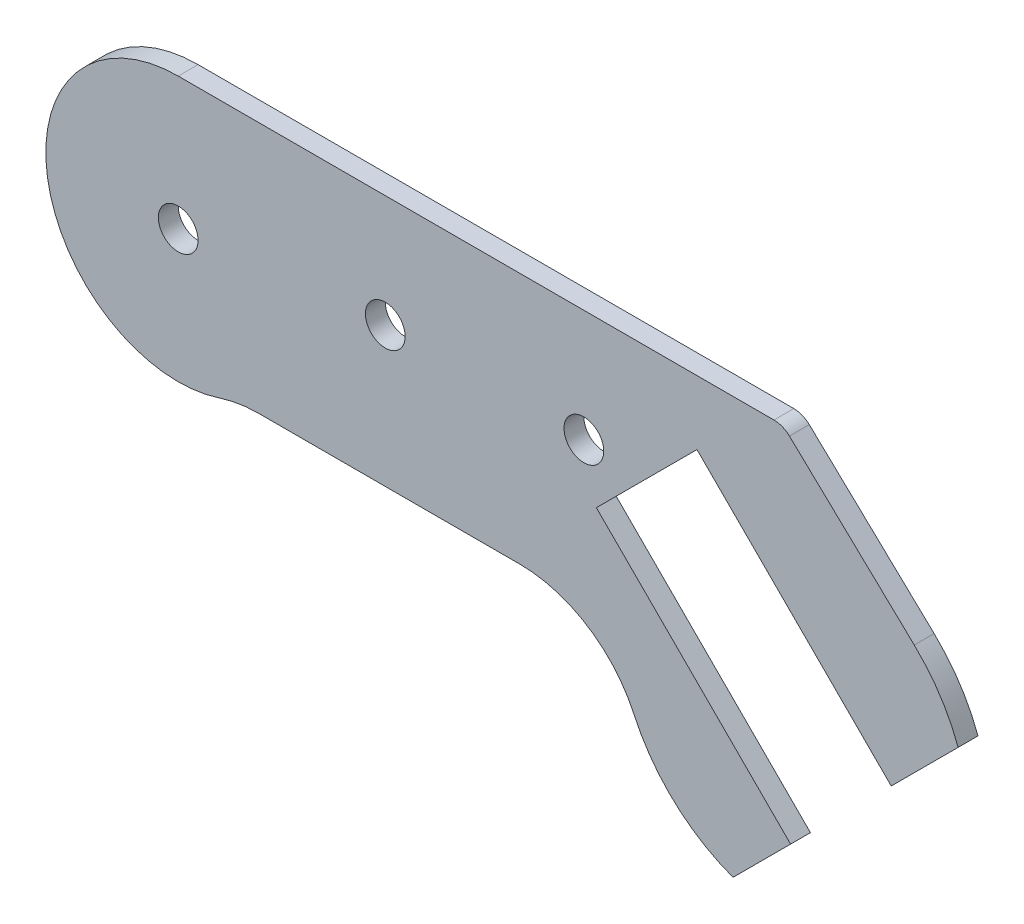
ISO-10303-21;
HEADER;
FILE_DESCRIPTION(('STEP AP214'),'2;1');
FILE_NAME('part.step','',(''),(''),'','','');
FILE_SCHEMA(('AUTOMOTIVE_DESIGN { 1 0 10303 214 1 1 1 1 }'));
ENDSEC;
DATA;
#1=APPLICATION_CONTEXT('core data for automotive mechanical design processes');
#2=APPLICATION_PROTOCOL_DEFINITION('international standard','automotive_design',2000,#1);
#3=PRODUCT_CONTEXT('',#1,'mechanical');
#4=PRODUCT('Part','Part','',(#3));
#5=PRODUCT_RELATED_PRODUCT_CATEGORY('part','',(#4));
#6=PRODUCT_DEFINITION_FORMATION('','',#4);
#7=PRODUCT_DEFINITION_CONTEXT('part definition',#1,'design');
#8=PRODUCT_DEFINITION('design','',#6,#7);
#9=PRODUCT_DEFINITION_SHAPE('','',#8);
#10=(LENGTH_UNIT() NAMED_UNIT(*) SI_UNIT(.MILLI.,.METRE.));
#11=(NAMED_UNIT(*) PLANE_ANGLE_UNIT() SI_UNIT($,.RADIAN.));
#12=(NAMED_UNIT(*) SI_UNIT($,.STERADIAN.) SOLID_ANGLE_UNIT());
#13=UNCERTAINTY_MEASURE_WITH_UNIT(LENGTH_MEASURE(1.E-05),#10,'distance_accuracy_value','');
#14=(GEOMETRIC_REPRESENTATION_CONTEXT(3) GLOBAL_UNCERTAINTY_ASSIGNED_CONTEXT((#13)) GLOBAL_UNIT_ASSIGNED_CONTEXT((#10,
#11,#12)) REPRESENTATION_CONTEXT('',''));
#15=CARTESIAN_POINT('',(0.,0.,0.));
#16=DIRECTION('',(0.,0.,1.));
#17=DIRECTION('',(1.,0.,0.));
#18=AXIS2_PLACEMENT_3D('',#15,#16,#17);
#19=CARTESIAN_POINT('',(91.6691076716509,-13.6086190586125,3.));
#20=DIRECTION('',(0.,0.,1.));
#21=DIRECTION('',(1.,0.,0.));
#22=AXIS2_PLACEMENT_3D('',#19,#20,#21);
#23=PLANE('',#22);
#24=CARTESIAN_POINT('',(30.,7.5,3.));
#25=DIRECTION('',(0.,0.,1.));
#26=DIRECTION('',(1.,0.,0.));
#27=AXIS2_PLACEMENT_3D('',#24,#25,#26);
#28=CIRCLE('',#27,3.);
#29=CARTESIAN_POINT('',(33.,7.5,3.));
#30=VERTEX_POINT('',#29);
#31=EDGE_CURVE('E312',#30,#30,#28,.T.);
#32=ORIENTED_EDGE('',*,*,#31,.F.);
#33=EDGE_LOOP('',(#32));
#34=FACE_BOUND('',#33,.T.);
#35=CARTESIAN_POINT('',(91.6691076716509,-13.6086190586125,3.));
#36=DIRECTION('',(0.,0.,1.));
#37=DIRECTION('',(1.,0.,0.));
#38=AXIS2_PLACEMENT_3D('',#35,#36,#37);
#39=CIRCLE('',#38,26.4969022625322);
#40=CARTESIAN_POINT('',(67.5999541346236,-24.6884059483133,3.));
#41=VERTEX_POINT('',#40);
#42=CARTESIAN_POINT('',(82.5347881546889,-38.4812955626044,3.));
#43=VERTEX_POINT('',#42);
#44=EDGE_CURVE('E193',#41,#43,#39,.T.);
#45=ORIENTED_EDGE('',*,*,#44,.T.);
#46=DIRECTION('',(0.707106781186548,0.707106781186547,0.));
#47=VECTOR('',#46,1.);
#48=CARTESIAN_POINT('',(91.2297814862239,-29.7863022310694,3.));
#49=LINE('',#48,#47);
#50=CARTESIAN_POINT('',(91.2297814862239,-29.7863022310694,3.));
#51=VERTEX_POINT('',#50);
#52=EDGE_CURVE('E111',#43,#51,#49,.T.);
#53=ORIENTED_EDGE('',*,*,#52,.T.);
#54=DIRECTION('',(-0.707106781186548,0.707106781186548,0.));
#55=VECTOR('',#54,1.);
#56=CARTESIAN_POINT('',(61.8848500669822,-0.441370811827673,3.));
#57=LINE('',#56,#55);
#58=CARTESIAN_POINT('',(61.8848500669822,-0.441370811827673,3.));
#59=VERTEX_POINT('',#58);
#60=EDGE_CURVE('E226',#51,#59,#57,.T.);
#61=ORIENTED_EDGE('',*,*,#60,.T.);
#62=DIRECTION('',(0.707106781186548,0.707106781186547,0.));
#63=VECTOR('',#62,1.);
#64=CARTESIAN_POINT('',(77.0876458624929,14.7614249836831,3.));
#65=LINE('',#64,#63);
#66=CARTESIAN_POINT('',(77.0876458624929,14.7614249836831,3.));
#67=VERTEX_POINT('',#66);
#68=EDGE_CURVE('E245',#59,#67,#65,.T.);
#69=ORIENTED_EDGE('',*,*,#68,.T.);
#70=DIRECTION('',(0.707106781186548,-0.707106781186547,0.));
#71=VECTOR('',#70,1.);
#72=CARTESIAN_POINT('',(77.0876458624929,14.7614249836831,3.));
#73=LINE('',#72,#71);
#74=CARTESIAN_POINT('',(106.432577281735,-14.5835064355586,3.));
#75=VERTEX_POINT('',#74);
#76=EDGE_CURVE('E242',#67,#75,#73,.T.);
#77=ORIENTED_EDGE('',*,*,#76,.T.);
#78=DIRECTION('',(0.707106781186547,0.707106781186548,0.));
#79=VECTOR('',#78,1.);
#80=CARTESIAN_POINT('',(116.541784175643,-4.47429954165048,3.));
#81=LINE('',#80,#79);
#82=CARTESIAN_POINT('',(116.541784175643,-4.47429954165048,3.));
#83=VERTEX_POINT('',#82);
#84=EDGE_CURVE('E244',#75,#83,#81,.T.);
#85=ORIENTED_EDGE('',*,*,#84,.T.);
#86=CARTESIAN_POINT('',(91.6691076716509,-13.6086190586125,3.));
#87=DIRECTION('',(0.,0.,1.));
#88=DIRECTION('',(1.,0.,0.));
#89=AXIS2_PLACEMENT_3D('',#86,#87,#88);
#90=CIRCLE('',#89,26.4969022625322);
#91=CARTESIAN_POINT('',(109.912759820697,5.6073895221201,3.));
#92=VERTEX_POINT('',#91);
#93=EDGE_CURVE('E247',#83,#92,#90,.T.);
#94=ORIENTED_EDGE('',*,*,#93,.T.);
#95=DIRECTION('',(-0.725217174080944,0.688520188823864,0.));
#96=VECTOR('',#95,1.);
#97=CARTESIAN_POINT('',(91.0571132945925,23.5089144315406,3.));
#98=LINE('',#97,#96);
#99=CARTESIAN_POINT('',(91.0571132945925,23.5089144315406,3.));
#100=VERTEX_POINT('',#99);
#101=EDGE_CURVE('E253',#92,#100,#98,.T.);
#102=ORIENTED_EDGE('',*,*,#101,.T.);
#103=CARTESIAN_POINT('',(88.7169995331069,21.0440764838959,3.));
#104=DIRECTION('',(0.,0.,1.));
#105=DIRECTION('',(1.,0.,0.));
#106=AXIS2_PLACEMENT_3D('',#103,#104,#105);
#107=CIRCLE('',#106,3.39875837988574);
#108=CARTESIAN_POINT('',(88.7169995331069,24.4428348637816,3.));
#109=VERTEX_POINT('',#108);
#110=EDGE_CURVE('E255',#100,#109,#107,.T.);
#111=ORIENTED_EDGE('',*,*,#110,.T.);
#112=DIRECTION('',(-1.,0.,0.));
#113=VECTOR('',#112,1.);
#114=CARTESIAN_POINT('',(-1.28300046689313,24.4428348637816,3.));
#115=LINE('',#114,#113);
#116=CARTESIAN_POINT('',(-1.28300046689313,24.4428348637816,3.));
#117=VERTEX_POINT('',#116);
#118=EDGE_CURVE('E257',#109,#117,#115,.T.);
#119=ORIENTED_EDGE('',*,*,#118,.T.);
#120=CARTESIAN_POINT('',(-1.28300046689313,4.44283486378164,3.));
#121=DIRECTION('',(0.,0.,1.));
#122=DIRECTION('',(1.,0.,0.));
#123=AXIS2_PLACEMENT_3D('',#120,#121,#122);
#124=CIRCLE('',#123,20.);
#125=CARTESIAN_POINT('',(4.95641889566602,-14.5589978377796,3.));
#126=VERTEX_POINT('',#125);
#127=EDGE_CURVE('E148',#117,#126,#124,.T.);
#128=ORIENTED_EDGE('',*,*,#127,.T.);
#129=CARTESIAN_POINT('',(10.8971181810218,-32.6510938151709,3.));
#130=DIRECTION('',(0.,0.,-1.));
#131=DIRECTION('',(1.,0.,0.));
#132=AXIS2_PLACEMENT_3D('',#129,#130,#131);
#133=CIRCLE('',#132,19.0424747565584);
#134=CARTESIAN_POINT('',(10.8971181810218,-13.6086190586125,3.));
#135=VERTEX_POINT('',#134);
#136=EDGE_CURVE('E142',#126,#135,#133,.T.);
#137=ORIENTED_EDGE('',*,*,#136,.T.);
#138=DIRECTION('',(1.,0.,0.));
#139=VECTOR('',#138,1.);
#140=CARTESIAN_POINT('',(50.302224607626,-13.6086190586125,3.));
#141=LINE('',#140,#139);
#142=CARTESIAN_POINT('',(50.302224607626,-13.6086190586125,3.));
#143=VERTEX_POINT('',#142);
#144=EDGE_CURVE('E146',#135,#143,#141,.T.);
#145=ORIENTED_EDGE('',*,*,#144,.T.);
#146=CARTESIAN_POINT('',(50.302224607626,-32.6510938151709,3.));
#147=DIRECTION('',(0.,0.,-1.));
#148=DIRECTION('',(-1.,0.,0.));
#149=AXIS2_PLACEMENT_3D('',#146,#147,#148);
#150=CIRCLE('',#149,19.0424747565585);
#151=EDGE_CURVE('E50',#143,#41,#150,.T.);
#152=ORIENTED_EDGE('',*,*,#151,.T.);
#153=EDGE_LOOP('',(#45,#53,#61,#69,#77,#85,#94,#102,#111,#119,#128,#137,#145,#152));
#154=FACE_BOUND('',#153,.T.);
#155=CARTESIAN_POINT('',(-1.28300046689313,4.44283486378164,3.));
#156=DIRECTION('',(0.,0.,1.));
#157=DIRECTION('',(1.,0.,0.));
#158=AXIS2_PLACEMENT_3D('',#155,#156,#157);
#159=CIRCLE('',#158,3.);
#160=CARTESIAN_POINT('',(1.71699953310687,4.44283486378164,3.));
#161=VERTEX_POINT('',#160);
#162=EDGE_CURVE('E170',#161,#161,#159,.T.);
#163=ORIENTED_EDGE('',*,*,#162,.F.);
#164=EDGE_LOOP('',(#163));
#165=FACE_BOUND('',#164,.T.);
#166=CARTESIAN_POINT('',(60.,7.5,3.));
#167=DIRECTION('',(0.,0.,1.));
#168=DIRECTION('',(1.,0.,0.));
#169=AXIS2_PLACEMENT_3D('',#166,#167,#168);
#170=CIRCLE('',#169,3.00000000000001);
#171=CARTESIAN_POINT('',(63.,7.5,3.));
#172=VERTEX_POINT('',#171);
#173=EDGE_CURVE('E303',#172,#172,#170,.T.);
#174=ORIENTED_EDGE('',*,*,#173,.F.);
#175=EDGE_LOOP('',(#174));
#176=FACE_BOUND('',#175,.T.);
#177=ADVANCED_FACE('F33',(#34,#154,#165,#176),#23,.T.);
#178=CARTESIAN_POINT('',(91.6691076716509,-13.6086190586125,0.));
#179=DIRECTION('',(0.,0.,1.));
#180=DIRECTION('',(1.,0.,0.));
#181=AXIS2_PLACEMENT_3D('',#178,#179,#180);
#182=PLANE('',#181);
#183=CARTESIAN_POINT('',(91.6691076716509,-13.6086190586125,0.));
#184=DIRECTION('',(0.,0.,1.));
#185=DIRECTION('',(1.,0.,0.));
#186=AXIS2_PLACEMENT_3D('',#183,#184,#185);
#187=CIRCLE('',#186,26.4969022625322);
#188=CARTESIAN_POINT('',(67.5999541346236,-24.6884059483133,0.));
#189=VERTEX_POINT('',#188);
#190=CARTESIAN_POINT('',(82.5347881546889,-38.4812955626044,0.));
#191=VERTEX_POINT('',#190);
#192=EDGE_CURVE('E166',#189,#191,#187,.T.);
#193=ORIENTED_EDGE('',*,*,#192,.F.);
#194=CARTESIAN_POINT('',(50.302224607626,-32.6510938151709,0.));
#195=DIRECTION('',(0.,0.,-1.));
#196=DIRECTION('',(-1.,0.,0.));
#197=AXIS2_PLACEMENT_3D('',#194,#195,#196);
#198=CIRCLE('',#197,19.0424747565585);
#199=CARTESIAN_POINT('',(50.302224607626,-13.6086190586125,0.));
#200=VERTEX_POINT('',#199);
#201=EDGE_CURVE('E103',#200,#189,#198,.T.);
#202=ORIENTED_EDGE('',*,*,#201,.F.);
#203=DIRECTION('',(1.,0.,0.));
#204=VECTOR('',#203,1.);
#205=CARTESIAN_POINT('',(50.302224607626,-13.6086190586125,0.));
#206=LINE('',#205,#204);
#207=CARTESIAN_POINT('',(10.8971181810218,-13.6086190586125,0.));
#208=VERTEX_POINT('',#207);
#209=EDGE_CURVE('E97',#208,#200,#206,.T.);
#210=ORIENTED_EDGE('',*,*,#209,.F.);
#211=CARTESIAN_POINT('',(10.8971181810218,-32.6510938151709,0.));
#212=DIRECTION('',(0.,0.,-1.));
#213=DIRECTION('',(1.,0.,0.));
#214=AXIS2_PLACEMENT_3D('',#211,#212,#213);
#215=CIRCLE('',#214,19.0424747565584);
#216=CARTESIAN_POINT('',(4.95641889566602,-14.5589978377796,0.));
#217=VERTEX_POINT('',#216);
#218=EDGE_CURVE('E156',#217,#208,#215,.T.);
#219=ORIENTED_EDGE('',*,*,#218,.F.);
#220=CARTESIAN_POINT('',(-1.28300046689313,4.44283486378164,0.));
#221=DIRECTION('',(0.,0.,1.));
#222=DIRECTION('',(1.,0.,0.));
#223=AXIS2_PLACEMENT_3D('',#220,#221,#222);
#224=CIRCLE('',#223,20.);
#225=CARTESIAN_POINT('',(-1.28300046689313,24.4428348637816,0.));
#226=VERTEX_POINT('',#225);
#227=EDGE_CURVE('E188',#226,#217,#224,.T.);
#228=ORIENTED_EDGE('',*,*,#227,.F.);
#229=DIRECTION('',(-1.,0.,0.));
#230=VECTOR('',#229,1.);
#231=CARTESIAN_POINT('',(-1.28300046689313,24.4428348637816,0.));
#232=LINE('',#231,#230);
#233=CARTESIAN_POINT('',(88.7169995331069,24.4428348637816,0.));
#234=VERTEX_POINT('',#233);
#235=EDGE_CURVE('E186',#234,#226,#232,.T.);
#236=ORIENTED_EDGE('',*,*,#235,.F.);
#237=CARTESIAN_POINT('',(88.7169995331069,21.0440764838959,0.));
#238=DIRECTION('',(0.,0.,1.));
#239=DIRECTION('',(1.,0.,0.));
#240=AXIS2_PLACEMENT_3D('',#237,#238,#239);
#241=CIRCLE('',#240,3.39875837988574);
#242=CARTESIAN_POINT('',(91.0571132945925,23.5089144315406,0.));
#243=VERTEX_POINT('',#242);
#244=EDGE_CURVE('E184',#243,#234,#241,.T.);
#245=ORIENTED_EDGE('',*,*,#244,.F.);
#246=DIRECTION('',(-0.725217174080944,0.688520188823864,0.));
#247=VECTOR('',#246,1.);
#248=CARTESIAN_POINT('',(91.0571132945925,23.5089144315406,0.));
#249=LINE('',#248,#247);
#250=CARTESIAN_POINT('',(109.912759820697,5.6073895221201,0.));
#251=VERTEX_POINT('',#250);
#252=EDGE_CURVE('E182',#251,#243,#249,.T.);
#253=ORIENTED_EDGE('',*,*,#252,.F.);
#254=CARTESIAN_POINT('',(91.6691076716509,-13.6086190586125,0.));
#255=DIRECTION('',(0.,0.,1.));
#256=DIRECTION('',(1.,0.,0.));
#257=AXIS2_PLACEMENT_3D('',#254,#255,#256);
#258=CIRCLE('',#257,26.4969022625322);
#259=CARTESIAN_POINT('',(116.541784175643,-4.47429954165048,0.));
#260=VERTEX_POINT('',#259);
#261=EDGE_CURVE('E180',#260,#251,#258,.T.);
#262=ORIENTED_EDGE('',*,*,#261,.F.);
#263=DIRECTION('',(0.707106781186547,0.707106781186548,0.));
#264=VECTOR('',#263,1.);
#265=CARTESIAN_POINT('',(116.541784175643,-4.47429954165048,0.));
#266=LINE('',#265,#264);
#267=CARTESIAN_POINT('',(106.432577281735,-14.5835064355586,0.));
#268=VERTEX_POINT('',#267);
#269=EDGE_CURVE('E178',#268,#260,#266,.T.);
#270=ORIENTED_EDGE('',*,*,#269,.F.);
#271=DIRECTION('',(0.707106781186548,-0.707106781186547,0.));
#272=VECTOR('',#271,1.);
#273=CARTESIAN_POINT('',(77.0876458624929,14.7614249836831,0.));
#274=LINE('',#273,#272);
#275=CARTESIAN_POINT('',(77.0876458624929,14.7614249836831,0.));
#276=VERTEX_POINT('',#275);
#277=EDGE_CURVE('E176',#276,#268,#274,.T.);
#278=ORIENTED_EDGE('',*,*,#277,.F.);
#279=DIRECTION('',(0.707106781186548,0.707106781186547,0.));
#280=VECTOR('',#279,1.);
#281=CARTESIAN_POINT('',(77.0876458624929,14.7614249836831,0.));
#282=LINE('',#281,#280);
#283=CARTESIAN_POINT('',(61.8848500669822,-0.441370811827673,0.));
#284=VERTEX_POINT('',#283);
#285=EDGE_CURVE('E174',#284,#276,#282,.T.);
#286=ORIENTED_EDGE('',*,*,#285,.F.);
#287=DIRECTION('',(-0.707106781186548,0.707106781186548,0.));
#288=VECTOR('',#287,1.);
#289=CARTESIAN_POINT('',(61.8848500669822,-0.441370811827673,0.));
#290=LINE('',#289,#288);
#291=CARTESIAN_POINT('',(91.2297814862239,-29.7863022310694,0.));
#292=VERTEX_POINT('',#291);
#293=EDGE_CURVE('E172',#292,#284,#290,.T.);
#294=ORIENTED_EDGE('',*,*,#293,.F.);
#295=DIRECTION('',(0.707106781186548,0.707106781186547,0.));
#296=VECTOR('',#295,1.);
#297=CARTESIAN_POINT('',(91.2297814862239,-29.7863022310694,0.));
#298=LINE('',#297,#296);
#299=EDGE_CURVE('E169',#191,#292,#298,.T.);
#300=ORIENTED_EDGE('',*,*,#299,.F.);
#301=EDGE_LOOP('',(#193,#202,#210,#219,#228,#236,#245,#253,#262,#270,#278,#286,#294,#300));
#302=FACE_BOUND('',#301,.T.);
#303=CARTESIAN_POINT('',(-1.28300046689313,4.44283486378164,0.));
#304=DIRECTION('',(0.,0.,1.));
#305=DIRECTION('',(1.,0.,0.));
#306=AXIS2_PLACEMENT_3D('',#303,#304,#305);
#307=CIRCLE('',#306,3.);
#308=CARTESIAN_POINT('',(1.71699953310687,4.44283486378164,0.));
#309=VERTEX_POINT('',#308);
#310=EDGE_CURVE('E315',#309,#309,#307,.T.);
#311=ORIENTED_EDGE('',*,*,#310,.T.);
#312=EDGE_LOOP('',(#311));
#313=FACE_BOUND('',#312,.T.);
#314=CARTESIAN_POINT('',(30.,7.5,0.));
#315=DIRECTION('',(0.,0.,1.));
#316=DIRECTION('',(1.,0.,0.));
#317=AXIS2_PLACEMENT_3D('',#314,#315,#316);
#318=CIRCLE('',#317,3.);
#319=CARTESIAN_POINT('',(33.,7.5,0.));
#320=VERTEX_POINT('',#319);
#321=EDGE_CURVE('E309',#320,#320,#318,.T.);
#322=ORIENTED_EDGE('',*,*,#321,.T.);
#323=EDGE_LOOP('',(#322));
#324=FACE_BOUND('',#323,.T.);
#325=CARTESIAN_POINT('',(60.,7.5,0.));
#326=DIRECTION('',(0.,0.,1.));
#327=DIRECTION('',(1.,0.,0.));
#328=AXIS2_PLACEMENT_3D('',#325,#326,#327);
#329=CIRCLE('',#328,3.00000000000001);
#330=CARTESIAN_POINT('',(63.,7.5,0.));
#331=VERTEX_POINT('',#330);
#332=EDGE_CURVE('E306',#331,#331,#329,.T.);
#333=ORIENTED_EDGE('',*,*,#332,.T.);
#334=EDGE_LOOP('',(#333));
#335=FACE_BOUND('',#334,.T.);
#336=ADVANCED_FACE('F230',(#302,#313,#324,#335),#182,.F.);
#337=CARTESIAN_POINT('',(91.6691076716509,-13.6086190586125,3.));
#338=DIRECTION('',(0.,0.,-1.));
#339=DIRECTION('',(-1.,0.,0.));
#340=AXIS2_PLACEMENT_3D('',#337,#338,#339);
#341=CYLINDRICAL_SURFACE('',#340,26.4969022625322);
#342=ORIENTED_EDGE('',*,*,#192,.T.);
#343=DIRECTION('',(0.,0.,-1.));
#344=VECTOR('',#343,1.);
#345=CARTESIAN_POINT('',(82.5347881546889,-38.4812955626044,3.));
#346=LINE('',#345,#344);
#347=EDGE_CURVE('E11',#43,#191,#346,.T.);
#348=ORIENTED_EDGE('',*,*,#347,.F.);
#349=ORIENTED_EDGE('',*,*,#44,.F.);
#350=DIRECTION('',(0.,0.,-1.));
#351=VECTOR('',#350,1.);
#352=CARTESIAN_POINT('',(67.5999541346236,-24.6884059483133,3.));
#353=LINE('',#352,#351);
#354=EDGE_CURVE('E162',#41,#189,#353,.T.);
#355=ORIENTED_EDGE('',*,*,#354,.T.);
#356=EDGE_LOOP('',(#342,#348,#349,#355));
#357=FACE_BOUND('',#356,.T.);
#358=ADVANCED_FACE('F35',(#357),#341,.T.);
#359=CARTESIAN_POINT('',(91.2297814862239,-29.7863022310694,3.));
#360=DIRECTION('',(-0.707106781186547,0.707106781186548,0.));
#361=DIRECTION('',(-0.707106781186548,-0.707106781186547,0.));
#362=AXIS2_PLACEMENT_3D('',#359,#360,#361);
#363=PLANE('',#362);
#364=ORIENTED_EDGE('',*,*,#299,.T.);
#365=DIRECTION('',(0.,0.,-1.));
#366=VECTOR('',#365,1.);
#367=CARTESIAN_POINT('',(91.2297814862239,-29.7863022310694,3.));
#368=LINE('',#367,#366);
#369=EDGE_CURVE('E42',#51,#292,#368,.T.);
#370=ORIENTED_EDGE('',*,*,#369,.F.);
#371=ORIENTED_EDGE('',*,*,#52,.F.);
#372=ORIENTED_EDGE('',*,*,#347,.T.);
#373=EDGE_LOOP('',(#364,#370,#371,#372));
#374=FACE_BOUND('',#373,.T.);
#375=ADVANCED_FACE('F437',(#374),#363,.F.);
#376=CARTESIAN_POINT('',(61.8848500669822,-0.441370811827673,3.));
#377=DIRECTION('',(-0.707106781186547,-0.707106781186547,0.));
#378=DIRECTION('',(0.707106781186548,-0.707106781186548,0.));
#379=AXIS2_PLACEMENT_3D('',#376,#377,#378);
#380=PLANE('',#379);
#381=ORIENTED_EDGE('',*,*,#293,.T.);
#382=DIRECTION('',(0.,0.,-1.));
#383=VECTOR('',#382,1.);
#384=CARTESIAN_POINT('',(61.8848500669822,-0.441370811827673,3.));
#385=LINE('',#384,#383);
#386=EDGE_CURVE('E218',#59,#284,#385,.T.);
#387=ORIENTED_EDGE('',*,*,#386,.F.);
#388=ORIENTED_EDGE('',*,*,#60,.F.);
#389=ORIENTED_EDGE('',*,*,#369,.T.);
#390=EDGE_LOOP('',(#381,#387,#388,#389));
#391=FACE_BOUND('',#390,.T.);
#392=ADVANCED_FACE('F224',(#391),#380,.F.);
#393=CARTESIAN_POINT('',(77.0876458624929,14.7614249836831,3.));
#394=DIRECTION('',(-0.707106781186547,0.707106781186548,0.));
#395=DIRECTION('',(-0.707106781186548,-0.707106781186547,0.));
#396=AXIS2_PLACEMENT_3D('',#393,#394,#395);
#397=PLANE('',#396);
#398=ORIENTED_EDGE('',*,*,#285,.T.);
#399=DIRECTION('',(0.,0.,-1.));
#400=VECTOR('',#399,1.);
#401=CARTESIAN_POINT('',(77.0876458624929,14.7614249836831,3.));
#402=LINE('',#401,#400);
#403=EDGE_CURVE('E215',#67,#276,#402,.T.);
#404=ORIENTED_EDGE('',*,*,#403,.F.);
#405=ORIENTED_EDGE('',*,*,#68,.F.);
#406=ORIENTED_EDGE('',*,*,#386,.T.);
#407=EDGE_LOOP('',(#398,#404,#405,#406));
#408=FACE_BOUND('',#407,.T.);
#409=ADVANCED_FACE('F236',(#408),#397,.F.);
#410=CARTESIAN_POINT('',(77.0876458624929,14.7614249836831,3.));
#411=DIRECTION('',(0.707106781186547,0.707106781186548,0.));
#412=DIRECTION('',(-0.707106781186548,0.707106781186547,0.));
#413=AXIS2_PLACEMENT_3D('',#410,#411,#412);
#414=PLANE('',#413);
#415=ORIENTED_EDGE('',*,*,#277,.T.);
#416=DIRECTION('',(0.,0.,-1.));
#417=VECTOR('',#416,1.);
#418=CARTESIAN_POINT('',(106.432577281735,-14.5835064355586,3.));
#419=LINE('',#418,#417);
#420=EDGE_CURVE('E212',#75,#268,#419,.T.);
#421=ORIENTED_EDGE('',*,*,#420,.F.);
#422=ORIENTED_EDGE('',*,*,#76,.F.);
#423=ORIENTED_EDGE('',*,*,#403,.T.);
#424=EDGE_LOOP('',(#415,#421,#422,#423));
#425=FACE_BOUND('',#424,.T.);
#426=ADVANCED_FACE('F240',(#425),#414,.F.);
#427=CARTESIAN_POINT('',(116.541784175643,-4.47429954165048,3.));
#428=DIRECTION('',(-0.707106781186548,0.707106781186547,0.));
#429=DIRECTION('',(-0.707106781186547,-0.707106781186548,0.));
#430=AXIS2_PLACEMENT_3D('',#427,#428,#429);
#431=PLANE('',#430);
#432=ORIENTED_EDGE('',*,*,#269,.T.);
#433=DIRECTION('',(0.,0.,-1.));
#434=VECTOR('',#433,1.);
#435=CARTESIAN_POINT('',(116.541784175643,-4.47429954165048,3.));
#436=LINE('',#435,#434);
#437=EDGE_CURVE('E209',#83,#260,#436,.T.);
#438=ORIENTED_EDGE('',*,*,#437,.F.);
#439=ORIENTED_EDGE('',*,*,#84,.F.);
#440=ORIENTED_EDGE('',*,*,#420,.T.);
#441=EDGE_LOOP('',(#432,#438,#439,#440));
#442=FACE_BOUND('',#441,.T.);
#443=ADVANCED_FACE('F402',(#442),#431,.F.);
#444=CARTESIAN_POINT('',(91.6691076716509,-13.6086190586125,3.));
#445=DIRECTION('',(0.,0.,-1.));
#446=DIRECTION('',(-1.,0.,0.));
#447=AXIS2_PLACEMENT_3D('',#444,#445,#446);
#448=CYLINDRICAL_SURFACE('',#447,26.4969022625322);
#449=ORIENTED_EDGE('',*,*,#261,.T.);
#450=DIRECTION('',(0.,0.,-1.));
#451=VECTOR('',#450,1.);
#452=CARTESIAN_POINT('',(109.912759820697,5.6073895221201,3.));
#453=LINE('',#452,#451);
#454=EDGE_CURVE('E206',#92,#251,#453,.T.);
#455=ORIENTED_EDGE('',*,*,#454,.F.);
#456=ORIENTED_EDGE('',*,*,#93,.F.);
#457=ORIENTED_EDGE('',*,*,#437,.T.);
#458=EDGE_LOOP('',(#449,#455,#456,#457));
#459=FACE_BOUND('',#458,.T.);
#460=ADVANCED_FACE('F392',(#459),#448,.T.);
#461=CARTESIAN_POINT('',(91.0571132945925,23.5089144315406,3.));
#462=DIRECTION('',(-0.688520188823864,-0.725217174080944,0.));
#463=DIRECTION('',(0.725217174080944,-0.688520188823864,0.));
#464=AXIS2_PLACEMENT_3D('',#461,#462,#463);
#465=PLANE('',#464);
#466=ORIENTED_EDGE('',*,*,#252,.T.);
#467=DIRECTION('',(0.,0.,-1.));
#468=VECTOR('',#467,1.);
#469=CARTESIAN_POINT('',(91.0571132945925,23.5089144315406,3.));
#470=LINE('',#469,#468);
#471=EDGE_CURVE('E203',#100,#243,#470,.T.);
#472=ORIENTED_EDGE('',*,*,#471,.F.);
#473=ORIENTED_EDGE('',*,*,#101,.F.);
#474=ORIENTED_EDGE('',*,*,#454,.T.);
#475=EDGE_LOOP('',(#466,#472,#473,#474));
#476=FACE_BOUND('',#475,.T.);
#477=ADVANCED_FACE('F382',(#476),#465,.F.);
#478=CARTESIAN_POINT('',(88.7169995331069,21.0440764838959,3.));
#479=DIRECTION('',(0.,0.,-1.));
#480=DIRECTION('',(-1.,0.,0.));
#481=AXIS2_PLACEMENT_3D('',#478,#479,#480);
#482=CYLINDRICAL_SURFACE('',#481,3.39875837988574);
#483=ORIENTED_EDGE('',*,*,#244,.T.);
#484=DIRECTION('',(0.,0.,-1.));
#485=VECTOR('',#484,1.);
#486=CARTESIAN_POINT('',(88.7169995331069,24.4428348637816,3.));
#487=LINE('',#486,#485);
#488=EDGE_CURVE('E200',#109,#234,#487,.T.);
#489=ORIENTED_EDGE('',*,*,#488,.F.);
#490=ORIENTED_EDGE('',*,*,#110,.F.);
#491=ORIENTED_EDGE('',*,*,#471,.T.);
#492=EDGE_LOOP('',(#483,#489,#490,#491));
#493=FACE_BOUND('',#492,.T.);
#494=ADVANCED_FACE('F373',(#493),#482,.T.);
#495=CARTESIAN_POINT('',(-1.28300046689313,24.4428348637816,3.));
#496=DIRECTION('',(0.,-1.,0.));
#497=DIRECTION('',(0.,0.,-1.));
#498=AXIS2_PLACEMENT_3D('',#495,#496,#497);
#499=PLANE('',#498);
#500=ORIENTED_EDGE('',*,*,#235,.T.);
#501=DIRECTION('',(0.,0.,-1.));
#502=VECTOR('',#501,1.);
#503=CARTESIAN_POINT('',(-1.28300046689313,24.4428348637816,3.));
#504=LINE('',#503,#502);
#505=EDGE_CURVE('E197',#117,#226,#504,.T.);
#506=ORIENTED_EDGE('',*,*,#505,.F.);
#507=ORIENTED_EDGE('',*,*,#118,.F.);
#508=ORIENTED_EDGE('',*,*,#488,.T.);
#509=EDGE_LOOP('',(#500,#506,#507,#508));
#510=FACE_BOUND('',#509,.T.);
#511=ADVANCED_FACE('F263',(#510),#499,.F.);
#512=CARTESIAN_POINT('',(-1.28300046689313,4.44283486378164,3.));
#513=DIRECTION('',(0.,0.,-1.));
#514=DIRECTION('',(-1.,0.,0.));
#515=AXIS2_PLACEMENT_3D('',#512,#513,#514);
#516=CYLINDRICAL_SURFACE('',#515,20.);
#517=ORIENTED_EDGE('',*,*,#227,.T.);
#518=DIRECTION('',(0.,0.,-1.));
#519=VECTOR('',#518,1.);
#520=CARTESIAN_POINT('',(4.95641889566602,-14.5589978377796,3.));
#521=LINE('',#520,#519);
#522=EDGE_CURVE('E157',#126,#217,#521,.T.);
#523=ORIENTED_EDGE('',*,*,#522,.F.);
#524=ORIENTED_EDGE('',*,*,#127,.F.);
#525=ORIENTED_EDGE('',*,*,#505,.T.);
#526=EDGE_LOOP('',(#517,#523,#524,#525));
#527=FACE_BOUND('',#526,.T.);
#528=ADVANCED_FACE('F267',(#527),#516,.T.);
#529=CARTESIAN_POINT('',(10.8971181810218,-32.6510938151709,3.));
#530=DIRECTION('',(0.,0.,-1.));
#531=DIRECTION('',(-1.,0.,0.));
#532=AXIS2_PLACEMENT_3D('',#529,#530,#531);
#533=CYLINDRICAL_SURFACE('',#532,19.0424747565584);
#534=ORIENTED_EDGE('',*,*,#218,.T.);
#535=DIRECTION('',(0.,0.,-1.));
#536=VECTOR('',#535,1.);
#537=CARTESIAN_POINT('',(10.8971181810218,-13.6086190586125,3.));
#538=LINE('',#537,#536);
#539=EDGE_CURVE('E153',#135,#208,#538,.T.);
#540=ORIENTED_EDGE('',*,*,#539,.F.);
#541=ORIENTED_EDGE('',*,*,#136,.F.);
#542=ORIENTED_EDGE('',*,*,#522,.T.);
#543=EDGE_LOOP('',(#534,#540,#541,#542));
#544=FACE_BOUND('',#543,.T.);
#545=ADVANCED_FACE('F154',(#544),#533,.F.);
#546=CARTESIAN_POINT('',(50.302224607626,-13.6086190586125,3.));
#547=DIRECTION('',(0.,1.,0.));
#548=DIRECTION('',(-1.,0.,0.));
#549=AXIS2_PLACEMENT_3D('',#546,#547,#548);
#550=PLANE('',#549);
#551=ORIENTED_EDGE('',*,*,#209,.T.);
#552=DIRECTION('',(0.,0.,-1.));
#553=VECTOR('',#552,1.);
#554=CARTESIAN_POINT('',(50.302224607626,-13.6086190586125,3.));
#555=LINE('',#554,#553);
#556=EDGE_CURVE('E158',#143,#200,#555,.T.);
#557=ORIENTED_EDGE('',*,*,#556,.F.);
#558=ORIENTED_EDGE('',*,*,#144,.F.);
#559=ORIENTED_EDGE('',*,*,#539,.T.);
#560=EDGE_LOOP('',(#551,#557,#558,#559));
#561=FACE_BOUND('',#560,.T.);
#562=ADVANCED_FACE('F160',(#561),#550,.F.);
#563=CARTESIAN_POINT('',(50.302224607626,-32.6510938151709,3.));
#564=DIRECTION('',(0.,0.,-1.));
#565=DIRECTION('',(-1.,0.,0.));
#566=AXIS2_PLACEMENT_3D('',#563,#564,#565);
#567=CYLINDRICAL_SURFACE('',#566,19.0424747565585);
#568=ORIENTED_EDGE('',*,*,#201,.T.);
#569=ORIENTED_EDGE('',*,*,#354,.F.);
#570=ORIENTED_EDGE('',*,*,#151,.F.);
#571=ORIENTED_EDGE('',*,*,#556,.T.);
#572=EDGE_LOOP('',(#568,#569,#570,#571));
#573=FACE_BOUND('',#572,.T.);
#574=ADVANCED_FACE('F271',(#573),#567,.F.);
#575=CARTESIAN_POINT('',(-1.28300046689313,4.44283486378164,3.));
#576=DIRECTION('',(0.,0.,-1.));
#577=DIRECTION('',(-1.,0.,0.));
#578=AXIS2_PLACEMENT_3D('',#575,#576,#577);
#579=CYLINDRICAL_SURFACE('',#578,3.);
#580=ORIENTED_EDGE('',*,*,#162,.T.);
#581=EDGE_LOOP('',(#580));
#582=FACE_BOUND('',#581,.T.);
#583=ORIENTED_EDGE('',*,*,#310,.F.);
#584=EDGE_LOOP('',(#583));
#585=FACE_BOUND('',#584,.T.);
#586=ADVANCED_FACE('F273',(#582,#585),#579,.F.);
#587=CARTESIAN_POINT('',(30.,7.5,3.));
#588=DIRECTION('',(0.,0.,-1.));
#589=DIRECTION('',(-1.,0.,0.));
#590=AXIS2_PLACEMENT_3D('',#587,#588,#589);
#591=CYLINDRICAL_SURFACE('',#590,3.);
#592=ORIENTED_EDGE('',*,*,#31,.T.);
#593=EDGE_LOOP('',(#592));
#594=FACE_BOUND('',#593,.T.);
#595=ORIENTED_EDGE('',*,*,#321,.F.);
#596=EDGE_LOOP('',(#595));
#597=FACE_BOUND('',#596,.T.);
#598=ADVANCED_FACE('F279',(#594,#597),#591,.F.);
#599=CARTESIAN_POINT('',(60.,7.5,3.));
#600=DIRECTION('',(0.,0.,-1.));
#601=DIRECTION('',(-1.,0.,0.));
#602=AXIS2_PLACEMENT_3D('',#599,#600,#601);
#603=CYLINDRICAL_SURFACE('',#602,3.00000000000001);
#604=ORIENTED_EDGE('',*,*,#173,.T.);
#605=EDGE_LOOP('',(#604));
#606=FACE_BOUND('',#605,.T.);
#607=ORIENTED_EDGE('',*,*,#332,.F.);
#608=EDGE_LOOP('',(#607));
#609=FACE_BOUND('',#608,.T.);
#610=ADVANCED_FACE('F294',(#606,#609),#603,.F.);
#611=CLOSED_SHELL('',(#177,#336,#358,#375,#392,#409,#426,#443,#460,#477,#494,#511,#528,#545,
#562,#574,#586,#598,#610));
#612=MANIFOLD_SOLID_BREP('B2',#611);
#613=ADVANCED_BREP_SHAPE_REPRESENTATION('',(#18,#612),#14);
#614=SHAPE_DEFINITION_REPRESENTATION(#9,#613);
ENDSEC;
END-ISO-10303-21;
